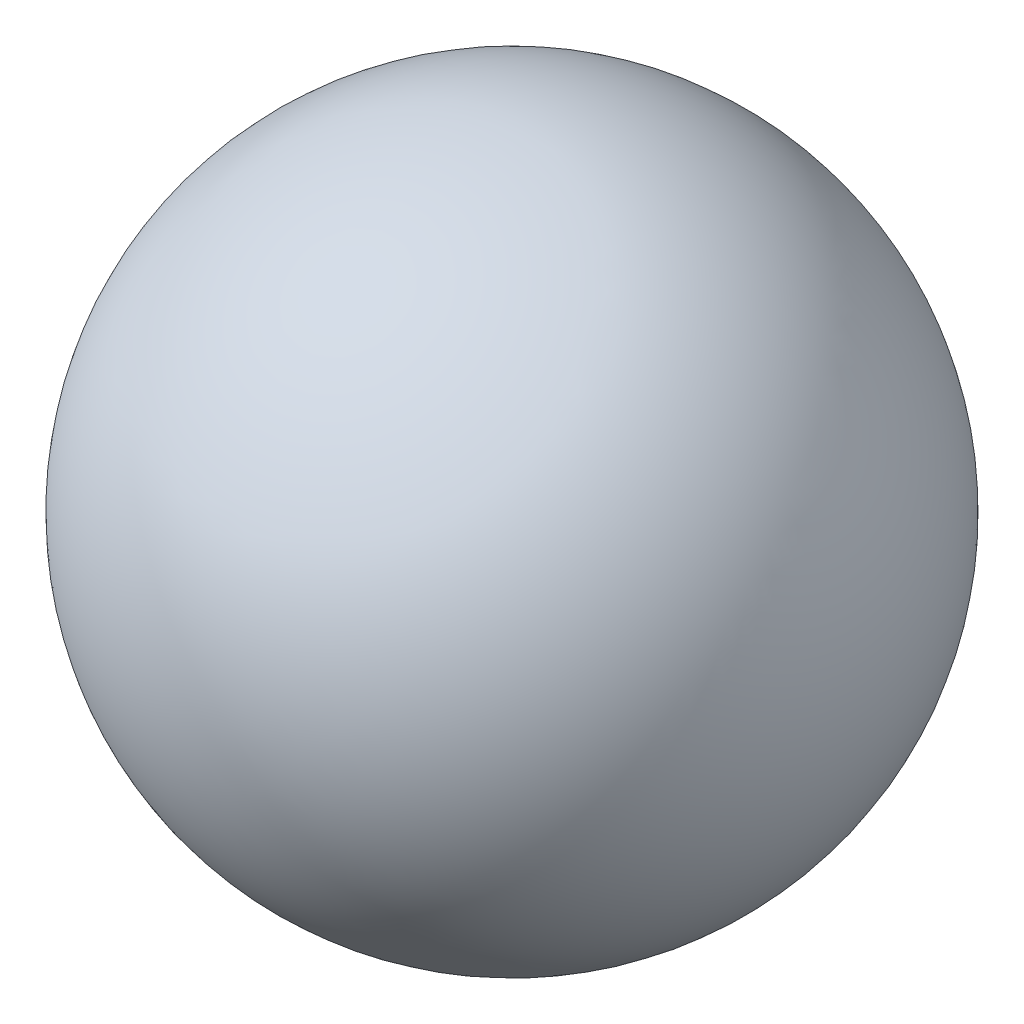
ISO-10303-21;
HEADER;
FILE_DESCRIPTION(('STEP AP214'),'2;1');
FILE_NAME('part.step','',(''),(''),'','','');
FILE_SCHEMA(('AUTOMOTIVE_DESIGN { 1 0 10303 214 1 1 1 1 }'));
ENDSEC;
DATA;
#1=APPLICATION_CONTEXT('core data for automotive mechanical design processes');
#2=APPLICATION_PROTOCOL_DEFINITION('international standard','automotive_design',2000,#1);
#3=PRODUCT_CONTEXT('',#1,'mechanical');
#4=PRODUCT('Part','Part','',(#3));
#5=PRODUCT_RELATED_PRODUCT_CATEGORY('part','',(#4));
#6=PRODUCT_DEFINITION_FORMATION('','',#4);
#7=PRODUCT_DEFINITION_CONTEXT('part definition',#1,'design');
#8=PRODUCT_DEFINITION('design','',#6,#7);
#9=PRODUCT_DEFINITION_SHAPE('','',#8);
#10=(LENGTH_UNIT() NAMED_UNIT(*) SI_UNIT(.MILLI.,.METRE.));
#11=(NAMED_UNIT(*) PLANE_ANGLE_UNIT() SI_UNIT($,.RADIAN.));
#12=(NAMED_UNIT(*) SI_UNIT($,.STERADIAN.) SOLID_ANGLE_UNIT());
#13=UNCERTAINTY_MEASURE_WITH_UNIT(LENGTH_MEASURE(1.E-05),#10,'distance_accuracy_value','');
#14=(GEOMETRIC_REPRESENTATION_CONTEXT(3) GLOBAL_UNCERTAINTY_ASSIGNED_CONTEXT((#13)) GLOBAL_UNIT_ASSIGNED_CONTEXT((#10,
#11,#12)) REPRESENTATION_CONTEXT('',''));
#15=CARTESIAN_POINT('',(0.,0.,0.));
#16=DIRECTION('',(0.,0.,1.));
#17=DIRECTION('',(1.,0.,0.));
#18=AXIS2_PLACEMENT_3D('',#15,#16,#17);
#19=CARTESIAN_POINT('',(0.,0.,0.));
#20=DIRECTION('',(0.683346286975334,0.724194465077481,0.0926295246029337));
#21=DIRECTION('',(0.118052702058754,-0.23480464405285,0.964847313655296));
#22=AXIS2_PLACEMENT_3D('',#19,#20,#21);
#23=SPHERICAL_SURFACE('',#22,0.794);
#24=CARTESIAN_POINT('',(-0.542576951858415,-0.57501040527152,-0.0735478425347295));
#25=VERTEX_POINT('',#24);
#26=VERTEX_LOOP('',#25);
#27=FACE_BOUND('',#26,.T.);
#28=CARTESIAN_POINT('',(0.542576951858415,0.57501040527152,0.0735478425347291));
#29=VERTEX_POINT('',#28);
#30=VERTEX_LOOP('',#29);
#31=FACE_BOUND('',#30,.T.);
#32=ADVANCED_FACE('F15',(#27,#31),#23,.T.);
#33=CLOSED_SHELL('',(#32));
#34=MANIFOLD_SOLID_BREP('B1',#33);
#35=ADVANCED_BREP_SHAPE_REPRESENTATION('',(#18,#34),#14);
#36=SHAPE_DEFINITION_REPRESENTATION(#9,#35);
ENDSEC;
END-ISO-10303-21;
